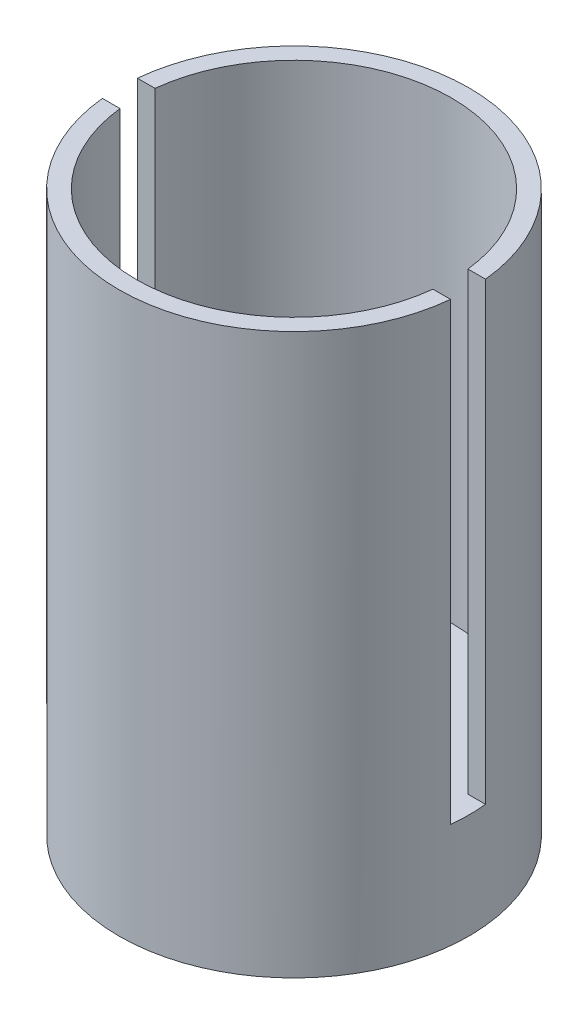
ISO-10303-21;
HEADER;
FILE_DESCRIPTION(('STEP AP214'),'2;1');
FILE_NAME('part.step','',(''),(''),'','','');
FILE_SCHEMA(('AUTOMOTIVE_DESIGN { 1 0 10303 214 1 1 1 1 }'));
ENDSEC;
DATA;
#1=APPLICATION_CONTEXT('core data for automotive mechanical design processes');
#2=APPLICATION_PROTOCOL_DEFINITION('international standard','automotive_design',2000,#1);
#3=PRODUCT_CONTEXT('',#1,'mechanical');
#4=PRODUCT('Part','Part','',(#3));
#5=PRODUCT_RELATED_PRODUCT_CATEGORY('part','',(#4));
#6=PRODUCT_DEFINITION_FORMATION('','',#4);
#7=PRODUCT_DEFINITION_CONTEXT('part definition',#1,'design');
#8=PRODUCT_DEFINITION('design','',#6,#7);
#9=PRODUCT_DEFINITION_SHAPE('','',#8);
#10=(LENGTH_UNIT() NAMED_UNIT(*) SI_UNIT(.MILLI.,.METRE.));
#11=(NAMED_UNIT(*) PLANE_ANGLE_UNIT() SI_UNIT($,.RADIAN.));
#12=(NAMED_UNIT(*) SI_UNIT($,.STERADIAN.) SOLID_ANGLE_UNIT());
#13=UNCERTAINTY_MEASURE_WITH_UNIT(LENGTH_MEASURE(1.E-05),#10,'distance_accuracy_value','');
#14=(GEOMETRIC_REPRESENTATION_CONTEXT(3) GLOBAL_UNCERTAINTY_ASSIGNED_CONTEXT((#13)) GLOBAL_UNIT_ASSIGNED_CONTEXT((#10,
#11,#12)) REPRESENTATION_CONTEXT('',''));
#15=CARTESIAN_POINT('',(0.,0.,0.));
#16=DIRECTION('',(0.,0.,1.));
#17=DIRECTION('',(1.,0.,0.));
#18=AXIS2_PLACEMENT_3D('',#15,#16,#17);
#19=CARTESIAN_POINT('',(0.,80.,0.));
#20=DIRECTION('',(0.,-1.,0.));
#21=DIRECTION('',(0.,0.,-1.));
#22=AXIS2_PLACEMENT_3D('',#19,#20,#21);
#23=CYLINDRICAL_SURFACE('',#22,22.5);
#24=DIRECTION('',(0.,-1.,0.));
#25=VECTOR('',#24,1.);
#26=CARTESIAN_POINT('',(-22.3606797749979,80.,2.5));
#27=LINE('',#26,#25);
#28=CARTESIAN_POINT('',(-22.3606797749979,80.,2.5));
#29=VERTEX_POINT('',#28);
#30=CARTESIAN_POINT('',(-22.3606797749979,15.,2.5));
#31=VERTEX_POINT('',#30);
#32=EDGE_CURVE('E127',#29,#31,#27,.T.);
#33=ORIENTED_EDGE('',*,*,#32,.F.);
#34=CARTESIAN_POINT('',(0.,80.,0.));
#35=DIRECTION('',(0.,1.,0.));
#36=DIRECTION('',(0.,0.,1.));
#37=AXIS2_PLACEMENT_3D('',#34,#35,#36);
#38=CIRCLE('',#37,22.5);
#39=CARTESIAN_POINT('',(22.3606797749979,80.,2.5));
#40=VERTEX_POINT('',#39);
#41=EDGE_CURVE('E129',#29,#40,#38,.T.);
#42=ORIENTED_EDGE('',*,*,#41,.T.);
#43=DIRECTION('',(0.,-1.,0.));
#44=VECTOR('',#43,1.);
#45=CARTESIAN_POINT('',(22.3606797749979,80.,2.5));
#46=LINE('',#45,#44);
#47=CARTESIAN_POINT('',(22.3606797749979,15.,2.5));
#48=VERTEX_POINT('',#47);
#49=EDGE_CURVE('E130',#48,#40,#46,.F.);
#50=ORIENTED_EDGE('',*,*,#49,.F.);
#51=CARTESIAN_POINT('',(0.,15.,0.));
#52=DIRECTION('',(0.,-1.,0.));
#53=DIRECTION('',(0.,0.,-1.));
#54=AXIS2_PLACEMENT_3D('',#51,#52,#53);
#55=CIRCLE('',#54,22.5);
#56=EDGE_CURVE('E126',#48,#31,#55,.T.);
#57=ORIENTED_EDGE('',*,*,#56,.T.);
#58=EDGE_LOOP('',(#33,#42,#50,#57));
#59=FACE_BOUND('',#58,.T.);
#60=ADVANCED_FACE('F41',(#59),#23,.F.);
#61=CARTESIAN_POINT('',(0.,80.,0.));
#62=DIRECTION('',(0.,1.,0.));
#63=DIRECTION('',(0.,0.,1.));
#64=AXIS2_PLACEMENT_3D('',#61,#62,#63);
#65=PLANE('',#64);
#66=DIRECTION('',(1.,0.,0.));
#67=VECTOR('',#66,1.);
#68=CARTESIAN_POINT('',(-25.,80.,2.5));
#69=LINE('',#68,#67);
#70=CARTESIAN_POINT('',(-24.8746859276655,80.,2.5));
#71=VERTEX_POINT('',#70);
#72=EDGE_CURVE('E158',#71,#29,#69,.T.);
#73=ORIENTED_EDGE('',*,*,#72,.F.);
#74=CARTESIAN_POINT('',(0.,80.,0.));
#75=DIRECTION('',(0.,1.,0.));
#76=DIRECTION('',(0.,0.,1.));
#77=AXIS2_PLACEMENT_3D('',#74,#75,#76);
#78=CIRCLE('',#77,25.);
#79=CARTESIAN_POINT('',(24.8746859276655,80.,2.5));
#80=VERTEX_POINT('',#79);
#81=EDGE_CURVE('E136',#71,#80,#78,.T.);
#82=ORIENTED_EDGE('',*,*,#81,.T.);
#83=EDGE_CURVE('E156',#40,#80,#69,.T.);
#84=ORIENTED_EDGE('',*,*,#83,.F.);
#85=ORIENTED_EDGE('',*,*,#41,.F.);
#86=EDGE_LOOP('',(#73,#82,#84,#85));
#87=FACE_BOUND('',#86,.T.);
#88=ADVANCED_FACE('F190',(#87),#65,.T.);
#89=CARTESIAN_POINT('',(0.,80.,0.));
#90=DIRECTION('',(0.,-1.,0.));
#91=DIRECTION('',(0.,0.,-1.));
#92=AXIS2_PLACEMENT_3D('',#89,#90,#91);
#93=CYLINDRICAL_SURFACE('',#92,25.);
#94=CARTESIAN_POINT('',(0.,0.,0.));
#95=DIRECTION('',(0.,1.,0.));
#96=DIRECTION('',(0.,0.,1.));
#97=AXIS2_PLACEMENT_3D('',#94,#95,#96);
#98=CIRCLE('',#97,25.);
#99=CARTESIAN_POINT('',(0.,0.,25.));
#100=VERTEX_POINT('',#99);
#101=EDGE_CURVE('E133',#100,#100,#98,.T.);
#102=ORIENTED_EDGE('',*,*,#101,.T.);
#103=EDGE_LOOP('',(#102));
#104=FACE_BOUND('',#103,.T.);
#105=DIRECTION('',(0.,-1.,0.));
#106=VECTOR('',#105,1.);
#107=CARTESIAN_POINT('',(-24.8746859276655,80.,2.5));
#108=LINE('',#107,#106);
#109=CARTESIAN_POINT('',(-24.8746859276655,15.,2.5));
#110=VERTEX_POINT('',#109);
#111=EDGE_CURVE('E144',#71,#110,#108,.T.);
#112=ORIENTED_EDGE('',*,*,#111,.T.);
#113=CARTESIAN_POINT('',(0.,15.,0.));
#114=DIRECTION('',(0.,-1.,0.));
#115=DIRECTION('',(0.,0.,-1.));
#116=AXIS2_PLACEMENT_3D('',#113,#114,#115);
#117=CIRCLE('',#116,25.);
#118=CARTESIAN_POINT('',(-24.8746859276655,15.,-2.5));
#119=VERTEX_POINT('',#118);
#120=EDGE_CURVE('E45',#110,#119,#117,.T.);
#121=ORIENTED_EDGE('',*,*,#120,.T.);
#122=DIRECTION('',(0.,-1.,0.));
#123=VECTOR('',#122,1.);
#124=CARTESIAN_POINT('',(-24.8746859276655,80.,-2.5));
#125=LINE('',#124,#123);
#126=CARTESIAN_POINT('',(-24.8746859276655,80.,-2.5));
#127=VERTEX_POINT('',#126);
#128=EDGE_CURVE('E121',#119,#127,#125,.F.);
#129=ORIENTED_EDGE('',*,*,#128,.T.);
#130=CARTESIAN_POINT('',(24.8746859276655,80.,-2.5));
#131=VERTEX_POINT('',#130);
#132=EDGE_CURVE('E140',#131,#127,#78,.T.);
#133=ORIENTED_EDGE('',*,*,#132,.F.);
#134=DIRECTION('',(0.,-1.,0.));
#135=VECTOR('',#134,1.);
#136=CARTESIAN_POINT('',(24.8746859276655,80.,-2.5));
#137=LINE('',#136,#135);
#138=CARTESIAN_POINT('',(24.8746859276655,15.,-2.5));
#139=VERTEX_POINT('',#138);
#140=EDGE_CURVE('E150',#131,#139,#137,.T.);
#141=ORIENTED_EDGE('',*,*,#140,.T.);
#142=CARTESIAN_POINT('',(24.8746859276655,15.,2.5));
#143=VERTEX_POINT('',#142);
#144=EDGE_CURVE('E11',#139,#143,#117,.T.);
#145=ORIENTED_EDGE('',*,*,#144,.T.);
#146=DIRECTION('',(0.,-1.,0.));
#147=VECTOR('',#146,1.);
#148=CARTESIAN_POINT('',(24.8746859276655,80.,2.5));
#149=LINE('',#148,#147);
#150=EDGE_CURVE('E111',#143,#80,#149,.F.);
#151=ORIENTED_EDGE('',*,*,#150,.T.);
#152=ORIENTED_EDGE('',*,*,#81,.F.);
#153=EDGE_LOOP('',(#112,#121,#129,#133,#141,#145,#151,#152));
#154=FACE_BOUND('',#153,.T.);
#155=ADVANCED_FACE('F43',(#104,#154),#93,.T.);
#156=DIRECTION('',(0.,-1.,0.));
#157=VECTOR('',#156,1.);
#158=CARTESIAN_POINT('',(22.3606797749979,80.,-2.5));
#159=LINE('',#158,#157);
#160=CARTESIAN_POINT('',(22.3606797749979,80.,-2.5));
#161=VERTEX_POINT('',#160);
#162=CARTESIAN_POINT('',(22.3606797749979,15.,-2.5));
#163=VERTEX_POINT('',#162);
#164=EDGE_CURVE('E103',#161,#163,#159,.T.);
#165=ORIENTED_EDGE('',*,*,#164,.F.);
#166=CARTESIAN_POINT('',(-22.3606797749979,80.,-2.5));
#167=VERTEX_POINT('',#166);
#168=EDGE_CURVE('E137',#161,#167,#38,.T.);
#169=ORIENTED_EDGE('',*,*,#168,.T.);
#170=DIRECTION('',(0.,-1.,0.));
#171=VECTOR('',#170,1.);
#172=CARTESIAN_POINT('',(-22.3606797749979,80.,-2.5));
#173=LINE('',#172,#171);
#174=CARTESIAN_POINT('',(-22.3606797749979,15.,-2.5));
#175=VERTEX_POINT('',#174);
#176=EDGE_CURVE('E112',#175,#167,#173,.F.);
#177=ORIENTED_EDGE('',*,*,#176,.F.);
#178=EDGE_CURVE('E118',#175,#163,#55,.T.);
#179=ORIENTED_EDGE('',*,*,#178,.T.);
#180=EDGE_LOOP('',(#165,#169,#177,#179));
#181=FACE_BOUND('',#180,.T.);
#182=ADVANCED_FACE('F125',(#181),#23,.F.);
#183=DIRECTION('',(-1.,0.,0.));
#184=VECTOR('',#183,1.);
#185=CARTESIAN_POINT('',(-25.,80.,-2.5));
#186=LINE('',#185,#184);
#187=EDGE_CURVE('E106',#131,#161,#186,.T.);
#188=ORIENTED_EDGE('',*,*,#187,.F.);
#189=ORIENTED_EDGE('',*,*,#132,.T.);
#190=EDGE_CURVE('E64',#167,#127,#186,.T.);
#191=ORIENTED_EDGE('',*,*,#190,.F.);
#192=ORIENTED_EDGE('',*,*,#168,.F.);
#193=EDGE_LOOP('',(#188,#189,#191,#192));
#194=FACE_BOUND('',#193,.T.);
#195=ADVANCED_FACE('F185',(#194),#65,.T.);
#196=CARTESIAN_POINT('',(0.,0.,0.));
#197=DIRECTION('',(0.,1.,0.));
#198=DIRECTION('',(0.,0.,1.));
#199=AXIS2_PLACEMENT_3D('',#196,#197,#198);
#200=PLANE('',#199);
#201=ORIENTED_EDGE('',*,*,#101,.F.);
#202=EDGE_LOOP('',(#201));
#203=FACE_BOUND('',#202,.T.);
#204=ADVANCED_FACE('F177',(#203),#200,.F.);
#205=CARTESIAN_POINT('',(0.,15.,0.));
#206=DIRECTION('',(0.,-1.,0.));
#207=DIRECTION('',(0.,0.,-1.));
#208=AXIS2_PLACEMENT_3D('',#205,#206,#207);
#209=PLANE('',#208);
#210=CARTESIAN_POINT('',(0.,15.,0.));
#211=DIRECTION('',(0.,1.,0.));
#212=DIRECTION('',(0.,0.,1.));
#213=AXIS2_PLACEMENT_3D('',#210,#211,#212);
#214=CIRCLE('',#213,5.);
#215=CARTESIAN_POINT('',(0.,15.,5.));
#216=VERTEX_POINT('',#215);
#217=EDGE_CURVE('E161',#216,#216,#214,.T.);
#218=ORIENTED_EDGE('',*,*,#217,.F.);
#219=EDGE_LOOP('',(#218));
#220=FACE_BOUND('',#219,.T.);
#221=ORIENTED_EDGE('',*,*,#178,.F.);
#222=DIRECTION('',(-1.,0.,0.));
#223=VECTOR('',#222,1.);
#224=CARTESIAN_POINT('',(-25.,15.,-2.5));
#225=LINE('',#224,#223);
#226=EDGE_CURVE('E122',#175,#119,#225,.T.);
#227=ORIENTED_EDGE('',*,*,#226,.T.);
#228=ORIENTED_EDGE('',*,*,#120,.F.);
#229=DIRECTION('',(1.,0.,0.));
#230=VECTOR('',#229,1.);
#231=CARTESIAN_POINT('',(-25.,15.,2.5));
#232=LINE('',#231,#230);
#233=EDGE_CURVE('E153',#110,#31,#232,.T.);
#234=ORIENTED_EDGE('',*,*,#233,.T.);
#235=ORIENTED_EDGE('',*,*,#56,.F.);
#236=EDGE_CURVE('E154',#48,#143,#232,.T.);
#237=ORIENTED_EDGE('',*,*,#236,.T.);
#238=ORIENTED_EDGE('',*,*,#144,.F.);
#239=EDGE_CURVE('E56',#139,#163,#225,.T.);
#240=ORIENTED_EDGE('',*,*,#239,.T.);
#241=EDGE_LOOP('',(#221,#227,#228,#234,#235,#237,#238,#240));
#242=FACE_BOUND('',#241,.T.);
#243=ADVANCED_FACE('F116',(#220,#242),#209,.F.);
#244=CARTESIAN_POINT('',(-25.,-35.2493781056045,-2.5));
#245=DIRECTION('',(0.,0.,-1.));
#246=DIRECTION('',(-1.,0.,0.));
#247=AXIS2_PLACEMENT_3D('',#244,#245,#246);
#248=PLANE('',#247);
#249=ORIENTED_EDGE('',*,*,#176,.T.);
#250=ORIENTED_EDGE('',*,*,#190,.T.);
#251=ORIENTED_EDGE('',*,*,#128,.F.);
#252=ORIENTED_EDGE('',*,*,#226,.F.);
#253=EDGE_LOOP('',(#249,#250,#251,#252));
#254=FACE_BOUND('',#253,.T.);
#255=ADVANCED_FACE('F176',(#254),#248,.F.);
#256=CARTESIAN_POINT('',(-25.,-35.2493781056045,2.5));
#257=DIRECTION('',(0.,0.,1.));
#258=DIRECTION('',(1.,0.,0.));
#259=AXIS2_PLACEMENT_3D('',#256,#257,#258);
#260=PLANE('',#259);
#261=ORIENTED_EDGE('',*,*,#32,.T.);
#262=ORIENTED_EDGE('',*,*,#233,.F.);
#263=ORIENTED_EDGE('',*,*,#111,.F.);
#264=ORIENTED_EDGE('',*,*,#72,.T.);
#265=EDGE_LOOP('',(#261,#262,#263,#264));
#266=FACE_BOUND('',#265,.T.);
#267=ADVANCED_FACE('F183',(#266),#260,.F.);
#268=ORIENTED_EDGE('',*,*,#49,.T.);
#269=ORIENTED_EDGE('',*,*,#83,.T.);
#270=ORIENTED_EDGE('',*,*,#150,.F.);
#271=ORIENTED_EDGE('',*,*,#236,.F.);
#272=EDGE_LOOP('',(#268,#269,#270,#271));
#273=FACE_BOUND('',#272,.T.);
#274=ADVANCED_FACE('F223',(#273),#260,.F.);
#275=ORIENTED_EDGE('',*,*,#164,.T.);
#276=ORIENTED_EDGE('',*,*,#239,.F.);
#277=ORIENTED_EDGE('',*,*,#140,.F.);
#278=ORIENTED_EDGE('',*,*,#187,.T.);
#279=EDGE_LOOP('',(#275,#276,#277,#278));
#280=FACE_BOUND('',#279,.T.);
#281=ADVANCED_FACE('F104',(#280),#248,.F.);
#282=CARTESIAN_POINT('',(0.,5.,0.));
#283=DIRECTION('',(0.,1.,0.));
#284=DIRECTION('',(0.,0.,1.));
#285=AXIS2_PLACEMENT_3D('',#282,#283,#284);
#286=CYLINDRICAL_SURFACE('',#285,5.);
#287=CARTESIAN_POINT('',(0.,5.,0.));
#288=DIRECTION('',(0.,1.,0.));
#289=DIRECTION('',(0.,0.,1.));
#290=AXIS2_PLACEMENT_3D('',#287,#288,#289);
#291=CIRCLE('',#290,5.);
#292=CARTESIAN_POINT('',(0.,5.,5.));
#293=VERTEX_POINT('',#292);
#294=EDGE_CURVE('E159',#293,#293,#291,.T.);
#295=ORIENTED_EDGE('',*,*,#294,.F.);
#296=EDGE_LOOP('',(#295));
#297=FACE_BOUND('',#296,.T.);
#298=ORIENTED_EDGE('',*,*,#217,.T.);
#299=EDGE_LOOP('',(#298));
#300=FACE_BOUND('',#299,.T.);
#301=ADVANCED_FACE('F169',(#297,#300),#286,.F.);
#302=CARTESIAN_POINT('',(0.,5.,0.));
#303=DIRECTION('',(0.,1.,0.));
#304=DIRECTION('',(0.,0.,1.));
#305=AXIS2_PLACEMENT_3D('',#302,#303,#304);
#306=PLANE('',#305);
#307=ORIENTED_EDGE('',*,*,#294,.T.);
#308=EDGE_LOOP('',(#307));
#309=FACE_BOUND('',#308,.T.);
#310=ADVANCED_FACE('F167',(#309),#306,.T.);
#311=CLOSED_SHELL('',(#60,#88,#155,#182,#195,#204,#243,#255,#267,#274,#281,#301,#310));
#312=MANIFOLD_SOLID_BREP('B2',#311);
#313=ADVANCED_BREP_SHAPE_REPRESENTATION('',(#18,#312),#14);
#314=SHAPE_DEFINITION_REPRESENTATION(#9,#313);
ENDSEC;
END-ISO-10303-21;
